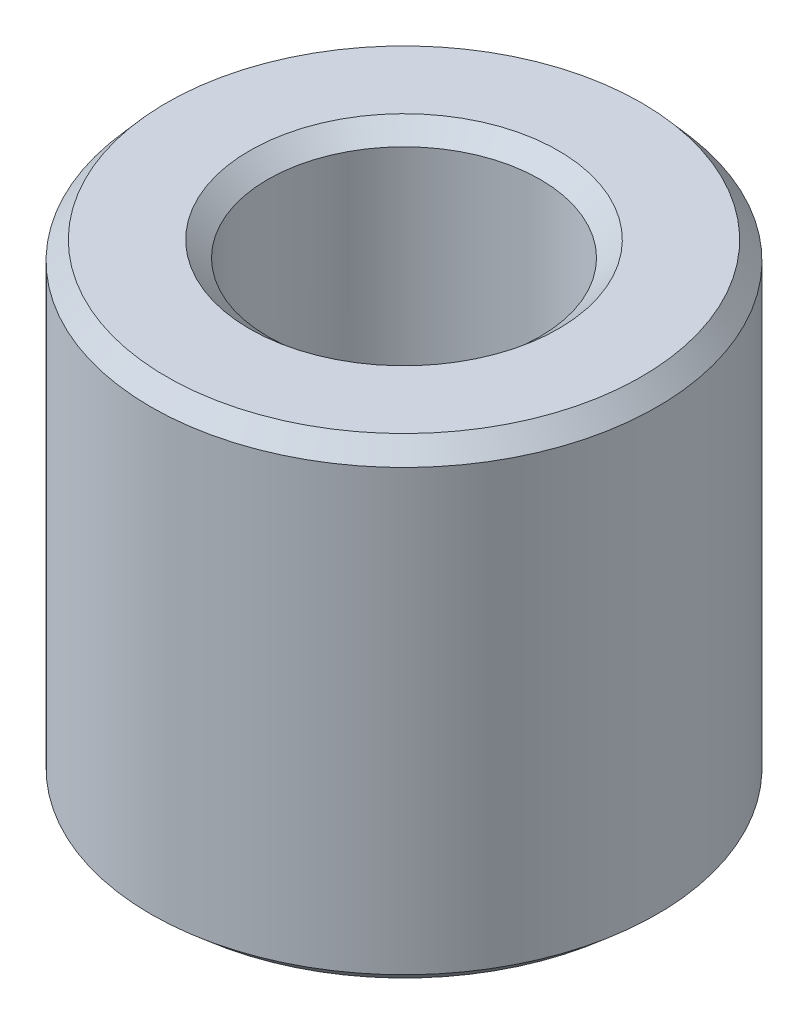
ISO-10303-21;
HEADER;
FILE_DESCRIPTION(('STEP AP214'),'2;1');
FILE_NAME('part.step','',(''),(''),'','','');
FILE_SCHEMA(('AUTOMOTIVE_DESIGN { 1 0 10303 214 1 1 1 1 }'));
ENDSEC;
DATA;
#1=APPLICATION_CONTEXT('core data for automotive mechanical design processes');
#2=APPLICATION_PROTOCOL_DEFINITION('international standard','automotive_design',2000,#1);
#3=PRODUCT_CONTEXT('',#1,'mechanical');
#4=PRODUCT('Part','Part','',(#3));
#5=PRODUCT_RELATED_PRODUCT_CATEGORY('part','',(#4));
#6=PRODUCT_DEFINITION_FORMATION('','',#4);
#7=PRODUCT_DEFINITION_CONTEXT('part definition',#1,'design');
#8=PRODUCT_DEFINITION('design','',#6,#7);
#9=PRODUCT_DEFINITION_SHAPE('','',#8);
#10=(LENGTH_UNIT() NAMED_UNIT(*) SI_UNIT(.MILLI.,.METRE.));
#11=(NAMED_UNIT(*) PLANE_ANGLE_UNIT() SI_UNIT($,.RADIAN.));
#12=(NAMED_UNIT(*) SI_UNIT($,.STERADIAN.) SOLID_ANGLE_UNIT());
#13=UNCERTAINTY_MEASURE_WITH_UNIT(LENGTH_MEASURE(1.E-05),#10,'distance_accuracy_value','');
#14=(GEOMETRIC_REPRESENTATION_CONTEXT(3) GLOBAL_UNCERTAINTY_ASSIGNED_CONTEXT((#13)) GLOBAL_UNIT_ASSIGNED_CONTEXT((#10,
#11,#12)) REPRESENTATION_CONTEXT('',''));
#15=CARTESIAN_POINT('',(0.,0.,0.));
#16=DIRECTION('',(0.,0.,1.));
#17=DIRECTION('',(1.,0.,0.));
#18=AXIS2_PLACEMENT_3D('',#15,#16,#17);
#19=CARTESIAN_POINT('',(0.,98.1657110122533,0.));
#20=DIRECTION('',(0.,-1.,0.));
#21=DIRECTION('',(0.,0.,-1.));
#22=AXIS2_PLACEMENT_3D('',#19,#20,#21);
#23=CYLINDRICAL_SURFACE('',#22,52.5);
#24=CARTESIAN_POINT('',(0.,3.26884323281869,0.));
#25=DIRECTION('',(0.,1.,0.));
#26=DIRECTION('',(0.,0.,1.));
#27=AXIS2_PLACEMENT_3D('',#24,#25,#26);
#28=CIRCLE('',#27,52.5);
#29=CARTESIAN_POINT('',(0.,3.26884323281867,-52.5));
#30=VERTEX_POINT('',#29);
#31=EDGE_CURVE('E10',#30,#30,#28,.T.);
#32=CARTESIAN_POINT('',(0.,94.3810266576048,0.));
#33=DIRECTION('',(0.,1.,0.));
#34=DIRECTION('',(0.,0.,1.));
#35=AXIS2_PLACEMENT_3D('',#32,#33,#34);
#36=CIRCLE('',#35,52.5);
#37=CARTESIAN_POINT('',(0.,94.3810266576048,-52.5));
#38=VERTEX_POINT('',#37);
#39=EDGE_CURVE('E50',#38,#38,#36,.F.);
#40=CARTESIAN_POINT('',(0.,3.26884323281867,-52.5));
#41=CARTESIAN_POINT('',(0.,4.21792847682687,-52.5));
#42=CARTESIAN_POINT('',(0.,5.16701372083506,-52.5));
#43=CARTESIAN_POINT('',(0.,7.06518420885143,-52.5));
#44=CARTESIAN_POINT('',(0.,8.01426945285962,-52.5));
#45=CARTESIAN_POINT('',(0.,9.912439940876,-52.5));
#46=CARTESIAN_POINT('',(0.,10.8615251848842,-52.5));
#47=CARTESIAN_POINT('',(0.,12.7596956729006,-52.5));
#48=CARTESIAN_POINT('',(0.,13.7087809169088,-52.5));
#49=CARTESIAN_POINT('',(0.,15.6069514049251,-52.5));
#50=CARTESIAN_POINT('',(0.,16.5560366489333,-52.5));
#51=CARTESIAN_POINT('',(0.,18.4542071369497,-52.5));
#52=CARTESIAN_POINT('',(0.,19.4032923809579,-52.5));
#53=CARTESIAN_POINT('',(0.,21.3014628689743,-52.5));
#54=CARTESIAN_POINT('',(0.,22.2505481129825,-52.5));
#55=CARTESIAN_POINT('',(0.,24.1487186009988,-52.5));
#56=CARTESIAN_POINT('',(0.,25.097803845007,-52.5));
#57=CARTESIAN_POINT('',(0.,26.9959743330234,-52.5));
#58=CARTESIAN_POINT('',(0.,27.9450595770316,-52.5));
#59=CARTESIAN_POINT('',(0.,29.843230065048,-52.5));
#60=CARTESIAN_POINT('',(0.,30.7923153090562,-52.5));
#61=CARTESIAN_POINT('',(0.,32.6904857970725,-52.5));
#62=CARTESIAN_POINT('',(0.,33.6395710410807,-52.5));
#63=CARTESIAN_POINT('',(0.,35.5377415290971,-52.5));
#64=CARTESIAN_POINT('',(0.,36.4868267731053,-52.5));
#65=CARTESIAN_POINT('',(0.,38.3849972611217,-52.5));
#66=CARTESIAN_POINT('',(0.,39.3340825051298,-52.5));
#67=CARTESIAN_POINT('',(0.,41.2322529931462,-52.5));
#68=CARTESIAN_POINT('',(0.,42.1813382371544,-52.5));
#69=CARTESIAN_POINT('',(0.,44.0795087251708,-52.5));
#70=CARTESIAN_POINT('',(0.,45.028593969179,-52.5));
#71=CARTESIAN_POINT('',(0.,46.9267644571954,-52.5));
#72=CARTESIAN_POINT('',(0.,47.8758497012035,-52.5));
#73=CARTESIAN_POINT('',(0.,49.7740201892199,-52.5));
#74=CARTESIAN_POINT('',(0.,50.7231054332281,-52.5));
#75=CARTESIAN_POINT('',(0.,52.6212759212445,-52.5));
#76=CARTESIAN_POINT('',(0.,53.5703611652527,-52.5));
#77=CARTESIAN_POINT('',(0.,55.4685316532691,-52.5));
#78=CARTESIAN_POINT('',(0.,56.4176168972772,-52.5));
#79=CARTESIAN_POINT('',(0.,58.3157873852936,-52.5));
#80=CARTESIAN_POINT('',(0.,59.2648726293018,-52.5));
#81=CARTESIAN_POINT('',(0.,61.1630431173182,-52.5));
#82=CARTESIAN_POINT('',(0.,62.1121283613264,-52.5));
#83=CARTESIAN_POINT('',(0.,64.0102988493428,-52.5));
#84=CARTESIAN_POINT('',(0.,64.9593840933509,-52.5));
#85=CARTESIAN_POINT('',(0.,66.8575545813673,-52.5));
#86=CARTESIAN_POINT('',(0.,67.8066398253755,-52.5));
#87=CARTESIAN_POINT('',(0.,69.7048103133919,-52.5));
#88=CARTESIAN_POINT('',(0.,70.6538955574001,-52.5));
#89=CARTESIAN_POINT('',(0.,72.5520660454165,-52.5));
#90=CARTESIAN_POINT('',(0.,73.5011512894246,-52.5));
#91=CARTESIAN_POINT('',(0.,75.399321777441,-52.5));
#92=CARTESIAN_POINT('',(0.,76.3484070214492,-52.5));
#93=CARTESIAN_POINT('',(0.,78.2465775094656,-52.5));
#94=CARTESIAN_POINT('',(0.,79.1956627534738,-52.5));
#95=CARTESIAN_POINT('',(0.,81.0938332414901,-52.5));
#96=CARTESIAN_POINT('',(0.,82.0429184854983,-52.5));
#97=CARTESIAN_POINT('',(0.,83.9410889735147,-52.5));
#98=CARTESIAN_POINT('',(0.,84.8901742175229,-52.5));
#99=CARTESIAN_POINT('',(0.,86.7883447055393,-52.5));
#100=CARTESIAN_POINT('',(0.,87.7374299495475,-52.5));
#101=CARTESIAN_POINT('',(0.,89.6356004375639,-52.5));
#102=CARTESIAN_POINT('',(0.,90.584685681572,-52.5));
#103=CARTESIAN_POINT('',(0.,92.4828561695884,-52.5));
#104=CARTESIAN_POINT('',(0.,93.4319414135966,-52.5));
#105=CARTESIAN_POINT('',(0.,94.3810266576048,-52.5));
#106=B_SPLINE_CURVE_WITH_KNOTS('',3,(#40,#41,#42,#43,#44,#45,#46,#47,#48,#49,#50,#51,#52,#53,
#54,#55,#56,#57,#58,#59,#60,#61,#62,#63,#64,#65,#66,#67,#68,#69,#70,#71,#72,#73,#74,#75,#76,#77,
#78,#79,#80,#81,#82,#83,#84,#85,#86,#87,#88,#89,#90,#91,#92,#93,#94,#95,#96,#97,#98,#99,#100,
#101,#102,#103,#104,#105),.UNSPECIFIED.,.F.,.F.,(4,2,2,2,2,2,2,2,2,2,2,2,2,2,2,2,2,2,2,2,2,2,2,
2,2,2,2,2,2,2,2,2,4),(0.,2.84725573202457,5.69451146404913,8.5417671960737,11.3890229280983,
14.2362786601228,17.0835343921474,19.930790124172,22.7780458561965,25.6253015882211,
28.4725573202457,31.3198130522702,34.1670687842948,37.0143245163194,39.8615802483439,
42.7088359803685,45.5560917123931,48.4033474444176,51.2506031764422,54.0978589084668,
56.9451146404913,59.7923703725159,62.6396261045405,65.486881836565,68.3341375685896,
71.1813933006142,74.0286490326387,76.8759047646633,79.7231604966879,82.5704162287124,
85.417671960737,88.2649276927615,91.1121834247861),.UNSPECIFIED.);
#107=EDGE_CURVE('BSEAM39',#30,#38,#106,.T.);
#108=ORIENTED_EDGE('',*,*,#31,.T.);
#109=ORIENTED_EDGE('',*,*,#39,.T.);
#110=ORIENTED_EDGE('',*,*,#107,.T.);
#111=ORIENTED_EDGE('',*,*,#107,.F.);
#112=EDGE_LOOP('',(#108,#110,#109,#111));
#113=FACE_BOUND('',#112,.T.);
#114=ADVANCED_FACE('F39',(#113),#23,.T.);
#115=CARTESIAN_POINT('',(0.,98.1657110122533,0.));
#116=DIRECTION('',(0.,1.,0.));
#117=DIRECTION('',(0.,0.,1.));
#118=AXIS2_PLACEMENT_3D('',#115,#116,#117);
#119=PLANE('',#118);
#120=CARTESIAN_POINT('',(0.,98.1657110122533,0.));
#121=DIRECTION('',(0.,1.,0.));
#122=DIRECTION('',(0.,0.,1.));
#123=AXIS2_PLACEMENT_3D('',#120,#121,#122);
#124=CIRCLE('',#123,32.0205988985124);
#125=CARTESIAN_POINT('',(0.,98.1657110122533,32.0205988985124));
#126=VERTEX_POINT('',#125);
#127=EDGE_CURVE('E58',#126,#126,#124,.F.);
#128=ORIENTED_EDGE('',*,*,#127,.T.);
#129=EDGE_LOOP('',(#128));
#130=FACE_BOUND('',#129,.T.);
#131=CARTESIAN_POINT('',(0.,98.1657110122533,0.));
#132=DIRECTION('',(0.,1.,0.));
#133=DIRECTION('',(0.,0.,1.));
#134=AXIS2_PLACEMENT_3D('',#131,#132,#133);
#135=CIRCLE('',#134,49.2311567671814);
#136=CARTESIAN_POINT('',(0.,98.1657110122533,-49.2311567671815));
#137=VERTEX_POINT('',#136);
#138=EDGE_CURVE('E61',#137,#137,#135,.T.);
#139=ORIENTED_EDGE('',*,*,#138,.T.);
#140=EDGE_LOOP('',(#139));
#141=FACE_BOUND('',#140,.T.);
#142=ADVANCED_FACE('F88',(#130,#141),#119,.T.);
#143=CARTESIAN_POINT('',(0.,0.,0.));
#144=DIRECTION('',(0.,1.,0.));
#145=DIRECTION('',(0.,0.,1.));
#146=AXIS2_PLACEMENT_3D('',#143,#144,#145);
#147=PLANE('',#146);
#148=CARTESIAN_POINT('',(0.,0.,0.));
#149=DIRECTION('',(0.,1.,0.));
#150=DIRECTION('',(0.,0.,1.));
#151=AXIS2_PLACEMENT_3D('',#148,#149,#150);
#152=CIRCLE('',#151,31.5047577766823);
#153=CARTESIAN_POINT('',(0.,0.,-31.5047577766823));
#154=VERTEX_POINT('',#153);
#155=EDGE_CURVE('E51',#154,#154,#152,.T.);
#156=ORIENTED_EDGE('',*,*,#155,.T.);
#157=EDGE_LOOP('',(#156));
#158=FACE_BOUND('',#157,.T.);
#159=CARTESIAN_POINT('',(0.,0.,0.));
#160=DIRECTION('',(0.,1.,0.));
#161=DIRECTION('',(0.,0.,1.));
#162=AXIS2_PLACEMENT_3D('',#159,#160,#161);
#163=CIRCLE('',#162,48.7153156453513);
#164=CARTESIAN_POINT('',(0.,0.,48.7153156453513));
#165=VERTEX_POINT('',#164);
#166=EDGE_CURVE('E54',#165,#165,#163,.F.);
#167=ORIENTED_EDGE('',*,*,#166,.T.);
#168=EDGE_LOOP('',(#167));
#169=FACE_BOUND('',#168,.T.);
#170=ADVANCED_FACE('F83',(#158,#169),#147,.F.);
#171=CARTESIAN_POINT('',(0.,98.1657110122533,0.));
#172=DIRECTION('',(0.,-1.,0.));
#173=DIRECTION('',(0.,0.,-1.));
#174=AXIS2_PLACEMENT_3D('',#171,#172,#173);
#175=CYLINDRICAL_SURFACE('',#174,28.2359145438637);
#176=CARTESIAN_POINT('',(0.,94.8968677794347,0.));
#177=DIRECTION('',(0.,1.,0.));
#178=DIRECTION('',(0.,0.,1.));
#179=AXIS2_PLACEMENT_3D('',#176,#177,#178);
#180=CIRCLE('',#179,28.2359145438637);
#181=CARTESIAN_POINT('',(0.,94.8968677794347,-28.2359145438637));
#182=VERTEX_POINT('',#181);
#183=EDGE_CURVE('E67',#182,#182,#180,.T.);
#184=CARTESIAN_POINT('',(0.,3.78468435464856,0.));
#185=DIRECTION('',(0.,1.,0.));
#186=DIRECTION('',(0.,0.,1.));
#187=AXIS2_PLACEMENT_3D('',#184,#185,#186);
#188=CIRCLE('',#187,28.2359145438637);
#189=CARTESIAN_POINT('',(0.,3.78468435464854,-28.2359145438637));
#190=VERTEX_POINT('',#189);
#191=EDGE_CURVE('E69',#190,#190,#188,.F.);
#192=CARTESIAN_POINT('',(0.,94.8968677794347,-28.2359145438637));
#193=CARTESIAN_POINT('',(0.,93.9477825354265,-28.2359145438637));
#194=CARTESIAN_POINT('',(0.,92.9986972914183,-28.2359145438637));
#195=CARTESIAN_POINT('',(0.,91.1005268034019,-28.2359145438637));
#196=CARTESIAN_POINT('',(0.,90.1514415593937,-28.2359145438637));
#197=CARTESIAN_POINT('',(0.,88.2532710713773,-28.2359145438637));
#198=CARTESIAN_POINT('',(0.,87.3041858273692,-28.2359145438637));
#199=CARTESIAN_POINT('',(0.,85.4060153393528,-28.2359145438637));
#200=CARTESIAN_POINT('',(0.,84.4569300953446,-28.2359145438637));
#201=CARTESIAN_POINT('',(0.,82.5587596073282,-28.2359145438637));
#202=CARTESIAN_POINT('',(0.,81.60967436332,-28.2359145438637));
#203=CARTESIAN_POINT('',(0.,79.7115038753036,-28.2359145438637));
#204=CARTESIAN_POINT('',(0.,78.7624186312954,-28.2359145438637));
#205=CARTESIAN_POINT('',(0.,76.8642481432791,-28.2359145438637));
#206=CARTESIAN_POINT('',(0.,75.9151628992709,-28.2359145438637));
#207=CARTESIAN_POINT('',(0.,74.0169924112545,-28.2359145438637));
#208=CARTESIAN_POINT('',(0.,73.0679071672463,-28.2359145438637));
#209=CARTESIAN_POINT('',(0.,71.1697366792299,-28.2359145438637));
#210=CARTESIAN_POINT('',(0.,70.2206514352218,-28.2359145438637));
#211=CARTESIAN_POINT('',(0.,68.3224809472054,-28.2359145438637));
#212=CARTESIAN_POINT('',(0.,67.3733957031972,-28.2359145438637));
#213=CARTESIAN_POINT('',(0.,65.4752252151808,-28.2359145438637));
#214=CARTESIAN_POINT('',(0.,64.5261399711726,-28.2359145438637));
#215=CARTESIAN_POINT('',(0.,62.6279694831562,-28.2359145438637));
#216=CARTESIAN_POINT('',(0.,61.6788842391481,-28.2359145438637));
#217=CARTESIAN_POINT('',(0.,59.7807137511317,-28.2359145438637));
#218=CARTESIAN_POINT('',(0.,58.8316285071235,-28.2359145438637));
#219=CARTESIAN_POINT('',(0.,56.9334580191071,-28.2359145438637));
#220=CARTESIAN_POINT('',(0.,55.9843727750989,-28.2359145438637));
#221=CARTESIAN_POINT('',(0.,54.0862022870825,-28.2359145438637));
#222=CARTESIAN_POINT('',(0.,53.1371170430744,-28.2359145438637));
#223=CARTESIAN_POINT('',(0.,51.238946555058,-28.2359145438637));
#224=CARTESIAN_POINT('',(0.,50.2898613110498,-28.2359145438637));
#225=CARTESIAN_POINT('',(0.,48.3916908230334,-28.2359145438637));
#226=CARTESIAN_POINT('',(0.,47.4426055790252,-28.2359145438637));
#227=CARTESIAN_POINT('',(0.,45.5444350910088,-28.2359145438637));
#228=CARTESIAN_POINT('',(0.,44.5953498470007,-28.2359145438637));
#229=CARTESIAN_POINT('',(0.,42.6971793589843,-28.2359145438637));
#230=CARTESIAN_POINT('',(0.,41.7480941149761,-28.2359145438637));
#231=CARTESIAN_POINT('',(0.,39.8499236269597,-28.2359145438637));
#232=CARTESIAN_POINT('',(0.,38.9008383829515,-28.2359145438637));
#233=CARTESIAN_POINT('',(0.,37.0026678949351,-28.2359145438637));
#234=CARTESIAN_POINT('',(0.,36.053582650927,-28.2359145438637));
#235=CARTESIAN_POINT('',(0.,34.1554121629106,-28.2359145438637));
#236=CARTESIAN_POINT('',(0.,33.2063269189024,-28.2359145438637));
#237=CARTESIAN_POINT('',(0.,31.308156430886,-28.2359145438637));
#238=CARTESIAN_POINT('',(0.,30.3590711868778,-28.2359145438637));
#239=CARTESIAN_POINT('',(0.,28.4609006988615,-28.2359145438637));
#240=CARTESIAN_POINT('',(0.,27.5118154548533,-28.2359145438637));
#241=CARTESIAN_POINT('',(0.,25.6136449668369,-28.2359145438637));
#242=CARTESIAN_POINT('',(0.,24.6645597228287,-28.2359145438637));
#243=CARTESIAN_POINT('',(0.,22.7663892348123,-28.2359145438637));
#244=CARTESIAN_POINT('',(0.,21.8173039908041,-28.2359145438637));
#245=CARTESIAN_POINT('',(0.,19.9191335027877,-28.2359145438637));
#246=CARTESIAN_POINT('',(0.,18.9700482587796,-28.2359145438637));
#247=CARTESIAN_POINT('',(0.,17.0718777707632,-28.2359145438637));
#248=CARTESIAN_POINT('',(0.,16.122792526755,-28.2359145438637));
#249=CARTESIAN_POINT('',(0.,14.2246220387386,-28.2359145438637));
#250=CARTESIAN_POINT('',(0.,13.2755367947304,-28.2359145438637));
#251=CARTESIAN_POINT('',(0.,11.377366306714,-28.2359145438637));
#252=CARTESIAN_POINT('',(0.,10.4282810627059,-28.2359145438637));
#253=CARTESIAN_POINT('',(0.,8.53011057468948,-28.2359145438637));
#254=CARTESIAN_POINT('',(0.,7.5810253306813,-28.2359145438637));
#255=CARTESIAN_POINT('',(0.,5.68285484266493,-28.2359145438637));
#256=CARTESIAN_POINT('',(0.,4.73376959865673,-28.2359145438637));
#257=CARTESIAN_POINT('',(0.,3.78468435464854,-28.2359145438637));
#258=B_SPLINE_CURVE_WITH_KNOTS('',3,(#192,#193,#194,#195,#196,#197,#198,#199,#200,#201,#202,
#203,#204,#205,#206,#207,#208,#209,#210,#211,#212,#213,#214,#215,#216,#217,#218,#219,#220,#221,
#222,#223,#224,#225,#226,#227,#228,#229,#230,#231,#232,#233,#234,#235,#236,#237,#238,#239,#240,
#241,#242,#243,#244,#245,#246,#247,#248,#249,#250,#251,#252,#253,#254,#255,#256,#257),
.UNSPECIFIED.,.F.,.F.,(4,2,2,2,2,2,2,2,2,2,2,2,2,2,2,2,2,2,2,2,2,2,2,2,2,2,2,2,2,2,2,2,4),(0.,
2.84725573202457,5.69451146404913,8.5417671960737,11.3890229280983,14.2362786601228,
17.0835343921474,19.930790124172,22.7780458561965,25.6253015882211,28.4725573202457,
31.3198130522702,34.1670687842948,37.0143245163194,39.8615802483439,42.7088359803685,
45.5560917123931,48.4033474444176,51.2506031764422,54.0978589084668,56.9451146404913,
59.7923703725159,62.6396261045404,65.486881836565,68.3341375685896,71.1813933006142,
74.0286490326387,76.8759047646633,79.7231604966879,82.5704162287124,85.417671960737,
88.2649276927615,91.1121834247861),.UNSPECIFIED.);
#259=EDGE_CURVE('BSEAM71',#182,#190,#258,.T.);
#260=ORIENTED_EDGE('',*,*,#183,.T.);
#261=ORIENTED_EDGE('',*,*,#191,.T.);
#262=ORIENTED_EDGE('',*,*,#259,.T.);
#263=ORIENTED_EDGE('',*,*,#259,.F.);
#264=EDGE_LOOP('',(#260,#262,#261,#263));
#265=FACE_BOUND('',#264,.T.);
#266=ADVANCED_FACE('F71',(#265),#175,.F.);
#267=CARTESIAN_POINT('',(0.,94.8968677794347,0.));
#268=DIRECTION('',(0.,1.,0.));
#269=DIRECTION('',(0.,0.,1.));
#270=AXIS2_PLACEMENT_3D('',#267,#268,#269);
#271=CONICAL_SURFACE('',#270,28.2359145438637,0.858400561660816);
#272=ORIENTED_EDGE('',*,*,#127,.F.);
#273=EDGE_LOOP('',(#272));
#274=FACE_BOUND('',#273,.T.);
#275=ORIENTED_EDGE('',*,*,#183,.F.);
#276=EDGE_LOOP('',(#275));
#277=FACE_BOUND('',#276,.T.);
#278=ADVANCED_FACE('F77',(#274,#277),#271,.F.);
#279=CARTESIAN_POINT('',(0.,0.,0.));
#280=DIRECTION('',(0.,-1.,0.));
#281=DIRECTION('',(0.,0.,-1.));
#282=AXIS2_PLACEMENT_3D('',#279,#280,#281);
#283=CONICAL_SURFACE('',#282,31.5047577766823,0.71239576513408);
#284=CARTESIAN_POINT('',(0.,3.78468435464856,-28.2359145438637));
#285=CARTESIAN_POINT('',(0.,3.74526055928763,-28.2699649942056));
#286=CARTESIAN_POINT('',(0.,3.70583676392671,-28.3040154445475));
#287=CARTESIAN_POINT('',(0.,3.62698917320487,-28.3721163452312));
#288=CARTESIAN_POINT('',(0.,3.58756537784394,-28.406166795573));
#289=CARTESIAN_POINT('',(0.,3.5087177871221,-28.4742676962568));
#290=CARTESIAN_POINT('',(0.,3.46929399176118,-28.5083181465986));
#291=CARTESIAN_POINT('',(0.,3.39044640103933,-28.5764190472823));
#292=CARTESIAN_POINT('',(0.,3.35102260567841,-28.6104694976242));
#293=CARTESIAN_POINT('',(0.,3.27217501495656,-28.6785703983079));
#294=CARTESIAN_POINT('',(0.,3.23275121959564,-28.7126208486498));
#295=CARTESIAN_POINT('',(0.,3.1539036288738,-28.7807217493335));
#296=CARTESIAN_POINT('',(0.,3.11447983351287,-28.8147721996754));
#297=CARTESIAN_POINT('',(0.,3.03563224279103,-28.8828731003591));
#298=CARTESIAN_POINT('',(0.,2.99620844743011,-28.9169235507009));
#299=CARTESIAN_POINT('',(0.,2.91736085670826,-28.9850244513847));
#300=CARTESIAN_POINT('',(0.,2.87793706134734,-29.0190749017265));
#301=CARTESIAN_POINT('',(0.,2.79908947062549,-29.0871758024102));
#302=CARTESIAN_POINT('',(0.,2.75966567526457,-29.1212262527521));
#303=CARTESIAN_POINT('',(0.,2.68081808454273,-29.1893271534358));
#304=CARTESIAN_POINT('',(0.,2.6413942891818,-29.2233776037777));
#305=CARTESIAN_POINT('',(0.,2.56254669845996,-29.2914785044614));
#306=CARTESIAN_POINT('',(0.,2.52312290309904,-29.3255289548033));
#307=CARTESIAN_POINT('',(0.,2.44427531237719,-29.393629855487));
#308=CARTESIAN_POINT('',(0.,2.40485151701627,-29.4276803058288));
#309=CARTESIAN_POINT('',(0.,2.32600392629442,-29.4957812065126));
#310=CARTESIAN_POINT('',(0.,2.2865801309335,-29.5298316568544));
#311=CARTESIAN_POINT('',(0.,2.20773254021166,-29.5979325575381));
#312=CARTESIAN_POINT('',(0.,2.16830874485073,-29.63198300788));
#313=CARTESIAN_POINT('',(0.,2.08946115412889,-29.7000839085637));
#314=CARTESIAN_POINT('',(0.,2.05003735876797,-29.7341343589056));
#315=CARTESIAN_POINT('',(0.,1.97118976804612,-29.8022352595893));
#316=CARTESIAN_POINT('',(0.,1.9317659726852,-29.8362857099312));
#317=CARTESIAN_POINT('',(0.,1.85291838196336,-29.9043866106149));
#318=CARTESIAN_POINT('',(0.,1.81349458660243,-29.9384370609567));
#319=CARTESIAN_POINT('',(0.,1.73464699588059,-30.0065379616405));
#320=CARTESIAN_POINT('',(0.,1.69522320051967,-30.0405884119823));
#321=CARTESIAN_POINT('',(0.,1.61637560979782,-30.108689312666));
#322=CARTESIAN_POINT('',(0.,1.5769518144369,-30.1427397630079));
#323=CARTESIAN_POINT('',(0.,1.49810422371505,-30.2108406636916));
#324=CARTESIAN_POINT('',(0.,1.45868042835413,-30.2448911140335));
#325=CARTESIAN_POINT('',(0.,1.37983283763229,-30.3129920147172));
#326=CARTESIAN_POINT('',(0.,1.34040904227136,-30.3470424650591));
#327=CARTESIAN_POINT('',(0.,1.26156145154952,-30.4151433657428));
#328=CARTESIAN_POINT('',(0.,1.2221376561886,-30.4491938160846));
#329=CARTESIAN_POINT('',(0.,1.14329006546675,-30.5172947167684));
#330=CARTESIAN_POINT('',(0.,1.10386627010583,-30.5513451671102));
#331=CARTESIAN_POINT('',(0.,1.02501867938398,-30.6194460677939));
#332=CARTESIAN_POINT('',(0.,0.985594884023062,-30.6534965181358));
#333=CARTESIAN_POINT('',(0.,0.906747293301217,-30.7215974188195));
#334=CARTESIAN_POINT('',(0.,0.867323497940294,-30.7556478691614));
#335=CARTESIAN_POINT('',(0.,0.788475907218449,-30.8237487698451));
#336=CARTESIAN_POINT('',(0.,0.749052111857527,-30.857799220187));
#337=CARTESIAN_POINT('',(0.,0.670204521135682,-30.9259001208707));
#338=CARTESIAN_POINT('',(0.,0.63078072577476,-30.9599505712125));
#339=CARTESIAN_POINT('',(0.,0.551933135052915,-31.0280514718963));
#340=CARTESIAN_POINT('',(0.,0.512509339691992,-31.0621019222381));
#341=CARTESIAN_POINT('',(0.,0.433661748970147,-31.1302028229218));
#342=CARTESIAN_POINT('',(0.,0.394237953609224,-31.1642532732637));
#343=CARTESIAN_POINT('',(0.,0.315390362887379,-31.2323541739474));
#344=CARTESIAN_POINT('',(0.,0.275966567526458,-31.2664046242893));
#345=CARTESIAN_POINT('',(0.,0.197118976804613,-31.334505524973));
#346=CARTESIAN_POINT('',(0.,0.15769518144369,-31.3685559753149));
#347=CARTESIAN_POINT('',(0.,0.0788475907218445,-31.4366568759986));
#348=CARTESIAN_POINT('',(0.,0.0394237953609216,-31.4707073263404));
#349=CARTESIAN_POINT('',(0.,0.,-31.5047577766823));
#350=B_SPLINE_CURVE_WITH_KNOTS('',3,(#284,#285,#286,#287,#288,#289,#290,#291,#292,#293,#294,
#295,#296,#297,#298,#299,#300,#301,#302,#303,#304,#305,#306,#307,#308,#309,#310,#311,#312,#313,
#314,#315,#316,#317,#318,#319,#320,#321,#322,#323,#324,#325,#326,#327,#328,#329,#330,#331,#332,
#333,#334,#335,#336,#337,#338,#339,#340,#341,#342,#343,#344,#345,#346,#347,#348,#349),
.UNSPECIFIED.,.F.,.F.,(4,2,2,2,2,2,2,2,2,2,2,2,2,2,2,2,2,2,2,2,2,2,2,2,2,2,2,2,2,2,2,2,4),(0.,
0.156278659075032,0.312557318150065,0.468835977225099,0.625114636300131,0.781393295375162,
0.937671954450196,1.09395061352523,1.25022927260026,1.40650793167529,1.56278659075033,
1.71906524982536,1.87534390890039,2.03162256797542,2.18790122705046,2.34417988612549,
2.50045854520052,2.65673720427555,2.81301586335059,2.96929452242562,3.12557318150065,
3.28185184057569,3.43813049965072,3.59440915872575,3.75068781780079,3.90696647687582,
4.06324513595085,4.21952379502589,4.37580245410092,4.53208111317595,4.68835977225099,
4.84463843132602,5.00091709040105),.UNSPECIFIED.);
#351=EDGE_CURVE('BSEAM73',#190,#154,#350,.T.);
#352=ORIENTED_EDGE('',*,*,#191,.F.);
#353=ORIENTED_EDGE('',*,*,#155,.F.);
#354=ORIENTED_EDGE('',*,*,#351,.T.);
#355=ORIENTED_EDGE('',*,*,#351,.F.);
#356=EDGE_LOOP('',(#352,#354,#353,#355));
#357=FACE_BOUND('',#356,.T.);
#358=ADVANCED_FACE('F73',(#357),#283,.F.);
#359=CARTESIAN_POINT('',(0.,3.26884323281869,0.));
#360=DIRECTION('',(0.,1.,0.));
#361=DIRECTION('',(0.,0.,1.));
#362=AXIS2_PLACEMENT_3D('',#359,#360,#361);
#363=CONICAL_SURFACE('',#362,52.5,0.858400561660817);
#364=ORIENTED_EDGE('',*,*,#166,.F.);
#365=EDGE_LOOP('',(#364));
#366=FACE_BOUND('',#365,.T.);
#367=ORIENTED_EDGE('',*,*,#31,.F.);
#368=EDGE_LOOP('',(#367));
#369=FACE_BOUND('',#368,.T.);
#370=ADVANCED_FACE('F76',(#366,#369),#363,.T.);
#371=CARTESIAN_POINT('',(0.,98.1657110122533,0.));
#372=DIRECTION('',(0.,-1.,0.));
#373=DIRECTION('',(0.,0.,-1.));
#374=AXIS2_PLACEMENT_3D('',#371,#372,#373);
#375=CONICAL_SURFACE('',#374,49.2311567671814,0.712395765134081);
#376=CARTESIAN_POINT('',(0.,94.3810266576048,-52.5));
#377=CARTESIAN_POINT('',(0.,94.4204504529657,-52.4659495496581));
#378=CARTESIAN_POINT('',(0.,94.4598742483266,-52.4318990993163));
#379=CARTESIAN_POINT('',(0.,94.5387218390485,-52.3637981986326));
#380=CARTESIAN_POINT('',(0.,94.5781456344094,-52.3297477482907));
#381=CARTESIAN_POINT('',(0.,94.6569932251313,-52.261646847607));
#382=CARTESIAN_POINT('',(0.,94.6964170204922,-52.2275963972651));
#383=CARTESIAN_POINT('',(0.,94.775264611214,-52.1594954965814));
#384=CARTESIAN_POINT('',(0.,94.8146884065749,-52.1254450462395));
#385=CARTESIAN_POINT('',(0.,94.8935359972968,-52.0573441455558));
#386=CARTESIAN_POINT('',(0.,94.9329597926577,-52.023293695214));
#387=CARTESIAN_POINT('',(0.,95.0118073833796,-51.9551927945302));
#388=CARTESIAN_POINT('',(0.,95.0512311787405,-51.9211423441884));
#389=CARTESIAN_POINT('',(0.,95.1300787694623,-51.8530414435047));
#390=CARTESIAN_POINT('',(0.,95.1695025648232,-51.8189909931628));
#391=CARTESIAN_POINT('',(0.,95.2483501555451,-51.7508900924791));
#392=CARTESIAN_POINT('',(0.,95.287773950906,-51.7168396421372));
#393=CARTESIAN_POINT('',(0.,95.3666215416279,-51.6487387414535));
#394=CARTESIAN_POINT('',(0.,95.4060453369888,-51.6146882911116));
#395=CARTESIAN_POINT('',(0.,95.4848929277106,-51.5465873904279));
#396=CARTESIAN_POINT('',(0.,95.5243167230715,-51.5125369400861));
#397=CARTESIAN_POINT('',(0.,95.6031643137934,-51.4444360394023));
#398=CARTESIAN_POINT('',(0.,95.6425881091543,-51.4103855890605));
#399=CARTESIAN_POINT('',(0.,95.7214356998762,-51.3422846883768));
#400=CARTESIAN_POINT('',(0.,95.7608594952371,-51.3082342380349));
#401=CARTESIAN_POINT('',(0.,95.8397070859589,-51.2401333373512));
#402=CARTESIAN_POINT('',(0.,95.8791308813198,-51.2060828870093));
#403=CARTESIAN_POINT('',(0.,95.9579784720417,-51.1379819863256));
#404=CARTESIAN_POINT('',(0.,95.9974022674026,-51.1039315359837));
#405=CARTESIAN_POINT('',(0.,96.0762498581245,-51.0358306353));
#406=CARTESIAN_POINT('',(0.,96.1156736534854,-51.0017801849582));
#407=CARTESIAN_POINT('',(0.,96.1945212442072,-50.9336792842744));
#408=CARTESIAN_POINT('',(0.,96.2339450395681,-50.8996288339326));
#409=CARTESIAN_POINT('',(0.,96.31279263029,-50.8315279332489));
#410=CARTESIAN_POINT('',(0.,96.3522164256509,-50.797477482907));
#411=CARTESIAN_POINT('',(0.,96.4310640163728,-50.7293765822233));
#412=CARTESIAN_POINT('',(0.,96.4704878117337,-50.6953261318814));
#413=CARTESIAN_POINT('',(0.,96.5493354024555,-50.6272252311977));
#414=CARTESIAN_POINT('',(0.,96.5887591978164,-50.5931747808558));
#415=CARTESIAN_POINT('',(0.,96.6676067885383,-50.5250738801721));
#416=CARTESIAN_POINT('',(0.,96.7070305838992,-50.4910234298303));
#417=CARTESIAN_POINT('',(0.,96.7858781746211,-50.4229225291465));
#418=CARTESIAN_POINT('',(0.,96.825301969982,-50.3888720788047));
#419=CARTESIAN_POINT('',(0.,96.9041495607038,-50.320771178121));
#420=CARTESIAN_POINT('',(0.,96.9435733560647,-50.2867207277791));
#421=CARTESIAN_POINT('',(0.,97.0224209467866,-50.2186198270954));
#422=CARTESIAN_POINT('',(0.,97.0618447421475,-50.1845693767535));
#423=CARTESIAN_POINT('',(0.,97.1406923328694,-50.1164684760698));
#424=CARTESIAN_POINT('',(0.,97.1801161282303,-50.082418025728));
#425=CARTESIAN_POINT('',(0.,97.2589637189521,-50.0143171250442));
#426=CARTESIAN_POINT('',(0.,97.298387514313,-49.9802666747024));
#427=CARTESIAN_POINT('',(0.,97.3772351050349,-49.9121657740186));
#428=CARTESIAN_POINT('',(0.,97.4166589003958,-49.8781153236768));
#429=CARTESIAN_POINT('',(0.,97.4955064911177,-49.8100144229931));
#430=CARTESIAN_POINT('',(0.,97.5349302864786,-49.7759639726512));
#431=CARTESIAN_POINT('',(0.,97.6137778772004,-49.7078630719675));
#432=CARTESIAN_POINT('',(0.,97.6532016725613,-49.6738126216256));
#433=CARTESIAN_POINT('',(0.,97.7320492632832,-49.6057117209419));
#434=CARTESIAN_POINT('',(0.,97.7714730586441,-49.5716612706001));
#435=CARTESIAN_POINT('',(0.,97.850320649366,-49.5035603699163));
#436=CARTESIAN_POINT('',(0.,97.8897444447269,-49.4695099195745));
#437=CARTESIAN_POINT('',(0.,97.9685920354487,-49.4014090188908));
#438=CARTESIAN_POINT('',(0.,98.0080158308096,-49.3673585685489));
#439=CARTESIAN_POINT('',(0.,98.0868634215315,-49.2992576678652));
#440=CARTESIAN_POINT('',(0.,98.1262872168924,-49.2652072175233));
#441=CARTESIAN_POINT('',(0.,98.1657110122533,-49.2311567671815));
#442=B_SPLINE_CURVE_WITH_KNOTS('',3,(#376,#377,#378,#379,#380,#381,#382,#383,#384,#385,#386,
#387,#388,#389,#390,#391,#392,#393,#394,#395,#396,#397,#398,#399,#400,#401,#402,#403,#404,#405,
#406,#407,#408,#409,#410,#411,#412,#413,#414,#415,#416,#417,#418,#419,#420,#421,#422,#423,#424,
#425,#426,#427,#428,#429,#430,#431,#432,#433,#434,#435,#436,#437,#438,#439,#440,#441),
.UNSPECIFIED.,.F.,.F.,(4,2,2,2,2,2,2,2,2,2,2,2,2,2,2,2,2,2,2,2,2,2,2,2,2,2,2,2,2,2,2,2,4),(0.,
0.156278659075031,0.312557318150072,0.468835977225107,0.625114636300138,0.781393295375168,
0.937671954450199,1.09395061352523,1.25022927260026,1.4065079316753,1.56278659075033,
1.71906524982536,1.87534390890039,2.03162256797542,2.18790122705045,2.34417988612548,
2.50045854520051,2.65673720427555,2.81301586335058,2.96929452242561,3.12557318150064,
3.28185184057567,3.4381304996507,3.59440915872573,3.75068781780077,3.9069664768758,
4.06324513595083,4.21952379502586,4.37580245410089,4.53208111317593,4.68835977225096,
4.84463843132599,5.00091709040103),.UNSPECIFIED.);
#443=EDGE_CURVE('BSEAM45',#38,#137,#442,.T.);
#444=ORIENTED_EDGE('',*,*,#39,.F.);
#445=ORIENTED_EDGE('',*,*,#138,.F.);
#446=ORIENTED_EDGE('',*,*,#443,.T.);
#447=ORIENTED_EDGE('',*,*,#443,.F.);
#448=EDGE_LOOP('',(#444,#446,#445,#447));
#449=FACE_BOUND('',#448,.T.);
#450=ADVANCED_FACE('F45',(#449),#375,.T.);
#451=CLOSED_SHELL('',(#114,#142,#170,#266,#278,#358,#370,#450));
#452=MANIFOLD_SOLID_BREP('B2',#451);
#453=ADVANCED_BREP_SHAPE_REPRESENTATION('',(#18,#452),#14);
#454=SHAPE_DEFINITION_REPRESENTATION(#9,#453);
ENDSEC;
END-ISO-10303-21;
